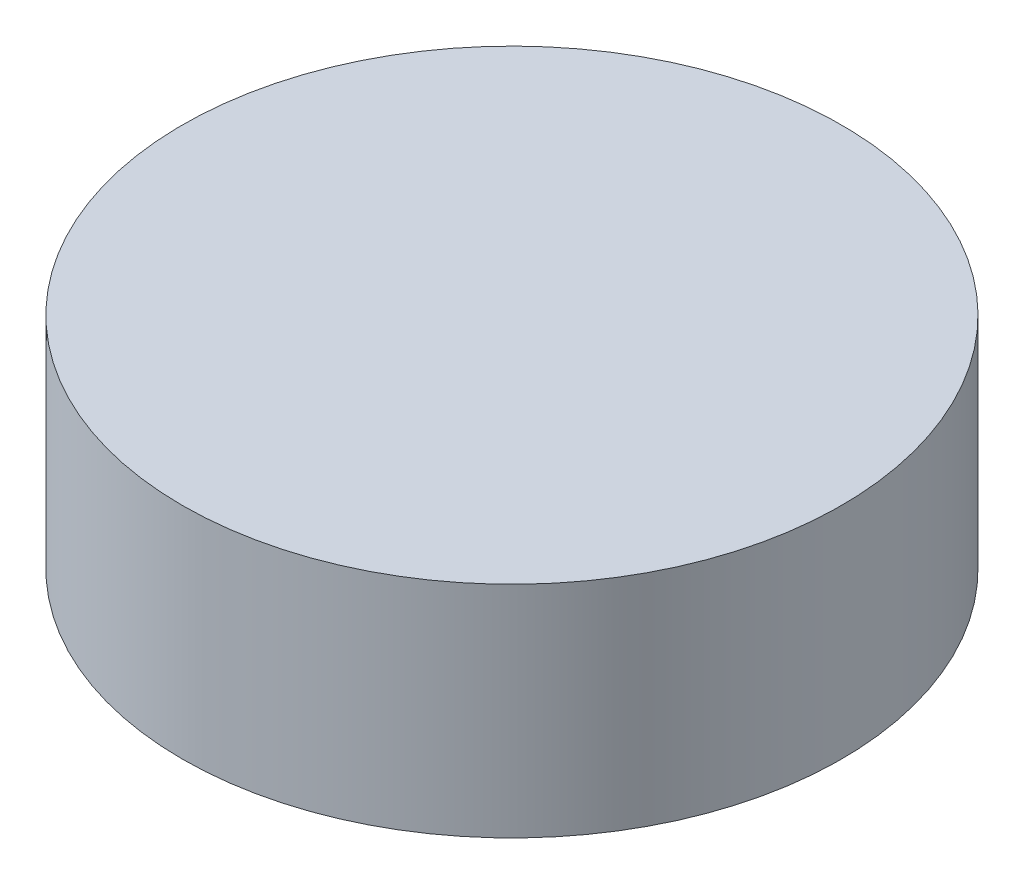
ISO-10303-21;
HEADER;
FILE_DESCRIPTION(('STEP AP214'),'2;1');
FILE_NAME('part.step','',(''),(''),'','','');
FILE_SCHEMA(('AUTOMOTIVE_DESIGN { 1 0 10303 214 1 1 1 1 }'));
ENDSEC;
DATA;
#1=APPLICATION_CONTEXT('core data for automotive mechanical design processes');
#2=APPLICATION_PROTOCOL_DEFINITION('international standard','automotive_design',2000,#1);
#3=PRODUCT_CONTEXT('',#1,'mechanical');
#4=PRODUCT('Part','Part','',(#3));
#5=PRODUCT_RELATED_PRODUCT_CATEGORY('part','',(#4));
#6=PRODUCT_DEFINITION_FORMATION('','',#4);
#7=PRODUCT_DEFINITION_CONTEXT('part definition',#1,'design');
#8=PRODUCT_DEFINITION('design','',#6,#7);
#9=PRODUCT_DEFINITION_SHAPE('','',#8);
#10=(LENGTH_UNIT() NAMED_UNIT(*) SI_UNIT(.MILLI.,.METRE.));
#11=(NAMED_UNIT(*) PLANE_ANGLE_UNIT() SI_UNIT($,.RADIAN.));
#12=(NAMED_UNIT(*) SI_UNIT($,.STERADIAN.) SOLID_ANGLE_UNIT());
#13=UNCERTAINTY_MEASURE_WITH_UNIT(LENGTH_MEASURE(1.E-05),#10,'distance_accuracy_value','');
#14=(GEOMETRIC_REPRESENTATION_CONTEXT(3) GLOBAL_UNCERTAINTY_ASSIGNED_CONTEXT((#13)) GLOBAL_UNIT_ASSIGNED_CONTEXT((#10,
#11,#12)) REPRESENTATION_CONTEXT('',''));
#15=CARTESIAN_POINT('',(0.,0.,0.));
#16=DIRECTION('',(0.,0.,1.));
#17=DIRECTION('',(1.,0.,0.));
#18=AXIS2_PLACEMENT_3D('',#15,#16,#17);
#19=CARTESIAN_POINT('',(0.,25.4,0.));
#20=DIRECTION('',(0.,-1.,0.));
#21=DIRECTION('',(0.,0.,-1.));
#22=AXIS2_PLACEMENT_3D('',#19,#20,#21);
#23=CYLINDRICAL_SURFACE('',#22,38.1);
#24=CARTESIAN_POINT('',(0.,25.4,0.));
#25=DIRECTION('',(0.,1.,0.));
#26=DIRECTION('',(0.,0.,1.));
#27=AXIS2_PLACEMENT_3D('',#24,#25,#26);
#28=CIRCLE('',#27,38.1);
#29=CARTESIAN_POINT('',(0.,25.4,38.1));
#30=VERTEX_POINT('',#29);
#31=EDGE_CURVE('E10',#30,#30,#28,.T.);
#32=ORIENTED_EDGE('',*,*,#31,.F.);
#33=EDGE_LOOP('',(#32));
#34=FACE_BOUND('',#33,.T.);
#35=CARTESIAN_POINT('',(0.,0.,0.));
#36=DIRECTION('',(0.,1.,0.));
#37=DIRECTION('',(0.,0.,1.));
#38=AXIS2_PLACEMENT_3D('',#35,#36,#37);
#39=CIRCLE('',#38,38.1);
#40=CARTESIAN_POINT('',(0.,0.,38.1));
#41=VERTEX_POINT('',#40);
#42=EDGE_CURVE('E38',#41,#41,#39,.T.);
#43=ORIENTED_EDGE('',*,*,#42,.T.);
#44=EDGE_LOOP('',(#43));
#45=FACE_BOUND('',#44,.T.);
#46=ADVANCED_FACE('F35',(#34,#45),#23,.T.);
#47=CARTESIAN_POINT('',(0.,25.4,0.));
#48=DIRECTION('',(0.,1.,0.));
#49=DIRECTION('',(0.,0.,1.));
#50=AXIS2_PLACEMENT_3D('',#47,#48,#49);
#51=PLANE('',#50);
#52=ORIENTED_EDGE('',*,*,#31,.T.);
#53=EDGE_LOOP('',(#52));
#54=FACE_BOUND('',#53,.T.);
#55=ADVANCED_FACE('F50',(#54),#51,.T.);
#56=CARTESIAN_POINT('',(0.,0.,0.));
#57=DIRECTION('',(0.,1.,0.));
#58=DIRECTION('',(0.,0.,1.));
#59=AXIS2_PLACEMENT_3D('',#56,#57,#58);
#60=PLANE('',#59);
#61=ORIENTED_EDGE('',*,*,#42,.F.);
#62=EDGE_LOOP('',(#61));
#63=FACE_BOUND('',#62,.T.);
#64=ADVANCED_FACE('F48',(#63),#60,.F.);
#65=CLOSED_SHELL('',(#46,#55,#64));
#66=MANIFOLD_SOLID_BREP('B2',#65);
#67=ADVANCED_BREP_SHAPE_REPRESENTATION('',(#18,#66),#14);
#68=SHAPE_DEFINITION_REPRESENTATION(#9,#67);
ENDSEC;
END-ISO-10303-21;
